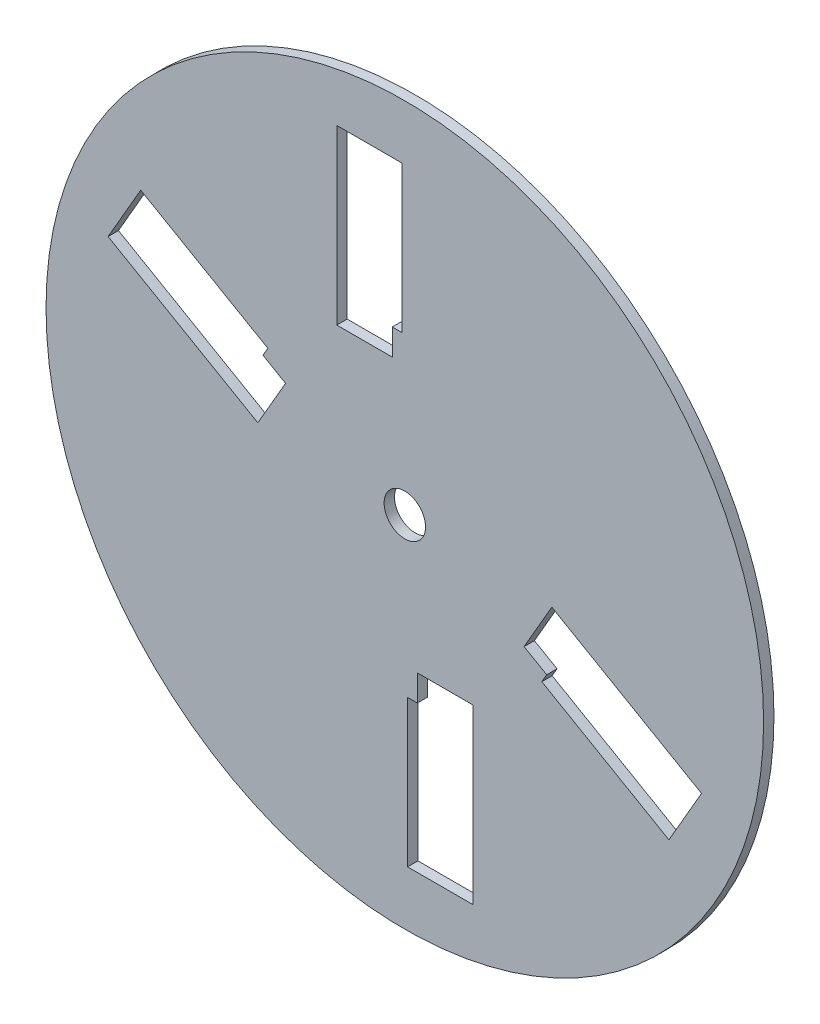
ISO-10303-21;
HEADER;
FILE_DESCRIPTION(('STEP AP214'),'2;1');
FILE_NAME('part.step','',(''),(''),'','','');
FILE_SCHEMA(('AUTOMOTIVE_DESIGN { 1 0 10303 214 1 1 1 1 }'));
ENDSEC;
DATA;
#1=APPLICATION_CONTEXT('core data for automotive mechanical design processes');
#2=APPLICATION_PROTOCOL_DEFINITION('international standard','automotive_design',2000,#1);
#3=PRODUCT_CONTEXT('',#1,'mechanical');
#4=PRODUCT('Part','Part','',(#3));
#5=PRODUCT_RELATED_PRODUCT_CATEGORY('part','',(#4));
#6=PRODUCT_DEFINITION_FORMATION('','',#4);
#7=PRODUCT_DEFINITION_CONTEXT('part definition',#1,'design');
#8=PRODUCT_DEFINITION('design','',#6,#7);
#9=PRODUCT_DEFINITION_SHAPE('','',#8);
#10=(LENGTH_UNIT() NAMED_UNIT(*) SI_UNIT(.MILLI.,.METRE.));
#11=(NAMED_UNIT(*) PLANE_ANGLE_UNIT() SI_UNIT($,.RADIAN.));
#12=(NAMED_UNIT(*) SI_UNIT($,.STERADIAN.) SOLID_ANGLE_UNIT());
#13=UNCERTAINTY_MEASURE_WITH_UNIT(LENGTH_MEASURE(1.E-05),#10,'distance_accuracy_value','');
#14=(GEOMETRIC_REPRESENTATION_CONTEXT(3) GLOBAL_UNCERTAINTY_ASSIGNED_CONTEXT((#13)) GLOBAL_UNIT_ASSIGNED_CONTEXT((#10,
#11,#12)) REPRESENTATION_CONTEXT('',''));
#15=CARTESIAN_POINT('',(0.,0.,0.));
#16=DIRECTION('',(0.,0.,1.));
#17=DIRECTION('',(1.,0.,0.));
#18=AXIS2_PLACEMENT_3D('',#15,#16,#17);
#19=CARTESIAN_POINT('',(-34.6410161513776,19.9999999999999,1.5875));
#20=DIRECTION('',(-0.86602540378444,0.499999999999998,0.));
#21=DIRECTION('',(-0.499999999999998,-0.86602540378444,0.));
#22=AXIS2_PLACEMENT_3D('',#19,#20,#21);
#23=PLANE('',#22);
#24=DIRECTION('',(0.499999999999998,0.86602540378444,0.));
#25=VECTOR('',#24,1.);
#26=CARTESIAN_POINT('',(-34.6410161513776,19.9999999999999,-1.5875));
#27=LINE('',#26,#25);
#28=CARTESIAN_POINT('',(-45.0660161513775,1.94337033109434,-1.5875));
#29=VERTEX_POINT('',#28);
#30=CARTESIAN_POINT('',(-36.5660161513776,16.6658021954298,-1.5875));
#31=VERTEX_POINT('',#30);
#32=EDGE_CURVE('E293',#29,#31,#27,.T.);
#33=ORIENTED_EDGE('',*,*,#32,.F.);
#34=DIRECTION('',(0.,0.,-1.));
#35=VECTOR('',#34,1.);
#36=CARTESIAN_POINT('',(-45.0660161513775,1.94337033109434,1.5875));
#37=LINE('',#36,#35);
#38=CARTESIAN_POINT('',(-45.0660161513775,1.94337033109434,1.5875));
#39=VERTEX_POINT('',#38);
#40=EDGE_CURVE('E11',#39,#29,#37,.T.);
#41=ORIENTED_EDGE('',*,*,#40,.F.);
#42=DIRECTION('',(0.499999999999998,0.86602540378444,0.));
#43=VECTOR('',#42,1.);
#44=CARTESIAN_POINT('',(-34.6410161513776,19.9999999999999,1.5875));
#45=LINE('',#44,#43);
#46=CARTESIAN_POINT('',(-36.5660161513776,16.6658021954298,1.5875));
#47=VERTEX_POINT('',#46);
#48=EDGE_CURVE('E418',#39,#47,#45,.T.);
#49=ORIENTED_EDGE('',*,*,#48,.T.);
#50=DIRECTION('',(0.,0.,-1.));
#51=VECTOR('',#50,1.);
#52=CARTESIAN_POINT('',(-36.5660161513776,16.6658021954298,1.5875));
#53=LINE('',#52,#51);
#54=EDGE_CURVE('E54',#47,#31,#53,.T.);
#55=ORIENTED_EDGE('',*,*,#54,.T.);
#56=EDGE_LOOP('',(#33,#41,#49,#55));
#57=FACE_BOUND('',#56,.T.);
#58=ADVANCED_FACE('F35',(#57),#23,.T.);
#59=CARTESIAN_POINT('',(-10.425,-18.0566296689056,1.5875));
#60=DIRECTION('',(0.499999999999998,0.86602540378444,0.));
#61=DIRECTION('',(-0.86602540378444,0.499999999999998,0.));
#62=AXIS2_PLACEMENT_3D('',#59,#60,#61);
#63=PLANE('',#62);
#64=DIRECTION('',(0.86602540378444,-0.499999999999998,0.));
#65=VECTOR('',#64,1.);
#66=CARTESIAN_POINT('',(-10.425,-18.0566296689056,-1.5875));
#67=LINE('',#66,#65);
#68=CARTESIAN_POINT('',(-90.9653625519529,28.4433703310942,-1.5875));
#69=VERTEX_POINT('',#68);
#70=EDGE_CURVE('E295',#69,#29,#67,.T.);
#71=ORIENTED_EDGE('',*,*,#70,.F.);
#72=DIRECTION('',(0.,0.,-1.));
#73=VECTOR('',#72,1.);
#74=CARTESIAN_POINT('',(-90.9653625519529,28.4433703310942,1.5875));
#75=LINE('',#74,#73);
#76=CARTESIAN_POINT('',(-90.9653625519529,28.4433703310942,1.5875));
#77=VERTEX_POINT('',#76);
#78=EDGE_CURVE('E45',#77,#69,#75,.T.);
#79=ORIENTED_EDGE('',*,*,#78,.F.);
#80=DIRECTION('',(0.86602540378444,-0.499999999999998,0.));
#81=VECTOR('',#80,1.);
#82=CARTESIAN_POINT('',(-10.425,-18.0566296689056,1.5875));
#83=LINE('',#82,#81);
#84=EDGE_CURVE('E420',#77,#39,#83,.T.);
#85=ORIENTED_EDGE('',*,*,#84,.T.);
#86=ORIENTED_EDGE('',*,*,#40,.T.);
#87=EDGE_LOOP('',(#71,#79,#85,#86));
#88=FACE_BOUND('',#87,.T.);
#89=ADVANCED_FACE('F445',(#88),#63,.T.);
#90=CARTESIAN_POINT('',(-80.5403625519529,46.4999999999998,1.5875));
#91=DIRECTION('',(0.86602540378444,-0.499999999999998,0.));
#92=DIRECTION('',(0.499999999999998,0.86602540378444,0.));
#93=AXIS2_PLACEMENT_3D('',#90,#91,#92);
#94=PLANE('',#93);
#95=DIRECTION('',(-0.499999999999998,-0.86602540378444,0.));
#96=VECTOR('',#95,1.);
#97=CARTESIAN_POINT('',(-80.5403625519529,46.4999999999998,-1.5875));
#98=LINE('',#97,#96);
#99=CARTESIAN_POINT('',(-80.9653625519529,45.763878406783,-1.5875));
#100=VERTEX_POINT('',#99);
#101=EDGE_CURVE('E298',#100,#69,#98,.T.);
#102=ORIENTED_EDGE('',*,*,#101,.F.);
#103=DIRECTION('',(0.,0.,-1.));
#104=VECTOR('',#103,1.);
#105=CARTESIAN_POINT('',(-80.9653625519529,45.763878406783,1.5875));
#106=LINE('',#105,#104);
#107=CARTESIAN_POINT('',(-80.9653625519529,45.763878406783,1.5875));
#108=VERTEX_POINT('',#107);
#109=EDGE_CURVE('E212',#108,#100,#106,.T.);
#110=ORIENTED_EDGE('',*,*,#109,.F.);
#111=DIRECTION('',(-0.499999999999998,-0.86602540378444,0.));
#112=VECTOR('',#111,1.);
#113=CARTESIAN_POINT('',(-80.5403625519529,46.4999999999998,1.5875));
#114=LINE('',#113,#112);
#115=EDGE_CURVE('E224',#108,#77,#114,.T.);
#116=ORIENTED_EDGE('',*,*,#115,.T.);
#117=ORIENTED_EDGE('',*,*,#78,.T.);
#118=EDGE_LOOP('',(#102,#110,#116,#117));
#119=FACE_BOUND('',#118,.T.);
#120=ADVANCED_FACE('F424',(#119),#94,.T.);
#121=CARTESIAN_POINT('',(-0.424999999999998,-0.736121593216774,1.5875));
#122=DIRECTION('',(-0.499999999999998,-0.86602540378444,0.));
#123=DIRECTION('',(0.86602540378444,-0.499999999999998,0.));
#124=AXIS2_PLACEMENT_3D('',#121,#122,#123);
#125=PLANE('',#124);
#126=DIRECTION('',(-0.86602540378444,0.499999999999998,0.));
#127=VECTOR('',#126,1.);
#128=CARTESIAN_POINT('',(-0.424999999999998,-0.736121593216774,-1.5875));
#129=LINE('',#128,#127);
#130=CARTESIAN_POINT('',(-41.9942193816531,23.2638784067831,-1.5875));
#131=VERTEX_POINT('',#130);
#132=EDGE_CURVE('E208',#131,#100,#129,.T.);
#133=ORIENTED_EDGE('',*,*,#132,.F.);
#134=DIRECTION('',(0.,0.,-1.));
#135=VECTOR('',#134,1.);
#136=CARTESIAN_POINT('',(-41.9942193816531,23.2638784067831,1.5875));
#137=LINE('',#136,#135);
#138=CARTESIAN_POINT('',(-41.9942193816531,23.2638784067831,1.5875));
#139=VERTEX_POINT('',#138);
#140=EDGE_CURVE('E203',#139,#131,#137,.T.);
#141=ORIENTED_EDGE('',*,*,#140,.F.);
#142=DIRECTION('',(-0.86602540378444,0.499999999999998,0.));
#143=VECTOR('',#142,1.);
#144=CARTESIAN_POINT('',(-0.424999999999998,-0.736121593216774,1.5875));
#145=LINE('',#144,#143);
#146=EDGE_CURVE('E206',#139,#108,#145,.T.);
#147=ORIENTED_EDGE('',*,*,#146,.T.);
#148=ORIENTED_EDGE('',*,*,#109,.T.);
#149=EDGE_LOOP('',(#133,#141,#147,#148));
#150=FACE_BOUND('',#149,.T.);
#151=ADVANCED_FACE('F205',(#150),#125,.T.);
#152=CARTESIAN_POINT('',(-41.5692193816531,23.9999999999999,1.5875));
#153=DIRECTION('',(-0.86602540378444,0.499999999999998,0.));
#154=DIRECTION('',(-0.499999999999998,-0.86602540378444,0.));
#155=AXIS2_PLACEMENT_3D('',#152,#153,#154);
#156=PLANE('',#155);
#157=DIRECTION('',(0.499999999999998,0.86602540378444,0.));
#158=VECTOR('',#157,1.);
#159=CARTESIAN_POINT('',(-41.5692193816531,23.9999999999999,-1.5875));
#160=LINE('',#159,#158);
#161=CARTESIAN_POINT('',(-43.4942193816531,20.6658021954298,-1.5875));
#162=VERTEX_POINT('',#161);
#163=EDGE_CURVE('E302',#162,#131,#160,.T.);
#164=ORIENTED_EDGE('',*,*,#163,.F.);
#165=DIRECTION('',(0.,0.,-1.));
#166=VECTOR('',#165,1.);
#167=CARTESIAN_POINT('',(-43.4942193816531,20.6658021954298,1.5875));
#168=LINE('',#167,#166);
#169=CARTESIAN_POINT('',(-43.4942193816531,20.6658021954298,1.5875));
#170=VERTEX_POINT('',#169);
#171=EDGE_CURVE('E127',#170,#162,#168,.T.);
#172=ORIENTED_EDGE('',*,*,#171,.F.);
#173=DIRECTION('',(0.499999999999998,0.86602540378444,0.));
#174=VECTOR('',#173,1.);
#175=CARTESIAN_POINT('',(-41.5692193816531,23.9999999999999,1.5875));
#176=LINE('',#175,#174);
#177=EDGE_CURVE('E221',#170,#139,#176,.T.);
#178=ORIENTED_EDGE('',*,*,#177,.T.);
#179=ORIENTED_EDGE('',*,*,#140,.T.);
#180=EDGE_LOOP('',(#164,#172,#178,#179));
#181=FACE_BOUND('',#180,.T.);
#182=ADVANCED_FACE('F226',(#181),#156,.T.);
#183=CARTESIAN_POINT('',(34.6410161513776,-19.9999999999999,1.5875));
#184=DIRECTION('',(0.86602540378444,-0.499999999999998,0.));
#185=DIRECTION('',(0.499999999999998,0.86602540378444,0.));
#186=AXIS2_PLACEMENT_3D('',#183,#184,#185);
#187=PLANE('',#186);
#188=DIRECTION('',(-0.499999999999998,-0.86602540378444,0.));
#189=VECTOR('',#188,1.);
#190=CARTESIAN_POINT('',(34.6410161513776,-19.9999999999999,-1.5875));
#191=LINE('',#190,#189);
#192=CARTESIAN_POINT('',(45.0660161513775,-1.94337033109434,-1.5875));
#193=VERTEX_POINT('',#192);
#194=CARTESIAN_POINT('',(36.5660161513776,-16.6658021954298,-1.5875));
#195=VERTEX_POINT('',#194);
#196=EDGE_CURVE('E275',#193,#195,#191,.T.);
#197=ORIENTED_EDGE('',*,*,#196,.F.);
#198=DIRECTION('',(0.,0.,-1.));
#199=VECTOR('',#198,1.);
#200=CARTESIAN_POINT('',(45.0660161513775,-1.94337033109434,1.5875));
#201=LINE('',#200,#199);
#202=CARTESIAN_POINT('',(45.0660161513775,-1.94337033109434,1.5875));
#203=VERTEX_POINT('',#202);
#204=EDGE_CURVE('E312',#203,#193,#201,.T.);
#205=ORIENTED_EDGE('',*,*,#204,.F.);
#206=DIRECTION('',(-0.499999999999998,-0.86602540378444,0.));
#207=VECTOR('',#206,1.);
#208=CARTESIAN_POINT('',(34.6410161513776,-19.9999999999999,1.5875));
#209=LINE('',#208,#207);
#210=CARTESIAN_POINT('',(36.5660161513776,-16.6658021954298,1.5875));
#211=VERTEX_POINT('',#210);
#212=EDGE_CURVE('E400',#203,#211,#209,.T.);
#213=ORIENTED_EDGE('',*,*,#212,.T.);
#214=DIRECTION('',(0.,0.,-1.));
#215=VECTOR('',#214,1.);
#216=CARTESIAN_POINT('',(36.5660161513776,-16.6658021954298,1.5875));
#217=LINE('',#216,#215);
#218=EDGE_CURVE('E316',#211,#195,#217,.T.);
#219=ORIENTED_EDGE('',*,*,#218,.T.);
#220=EDGE_LOOP('',(#197,#205,#213,#219));
#221=FACE_BOUND('',#220,.T.);
#222=ADVANCED_FACE('F470',(#221),#187,.T.);
#223=CARTESIAN_POINT('',(10.4249999999999,18.0566296689056,1.5875));
#224=DIRECTION('',(-0.499999999999997,-0.86602540378444,0.));
#225=DIRECTION('',(0.86602540378444,-0.499999999999997,0.));
#226=AXIS2_PLACEMENT_3D('',#223,#224,#225);
#227=PLANE('',#226);
#228=DIRECTION('',(-0.86602540378444,0.499999999999997,0.));
#229=VECTOR('',#228,1.);
#230=CARTESIAN_POINT('',(10.4249999999999,18.0566296689056,-1.5875));
#231=LINE('',#230,#229);
#232=CARTESIAN_POINT('',(90.9653625519529,-28.4433703310942,-1.5875));
#233=VERTEX_POINT('',#232);
#234=EDGE_CURVE('E278',#233,#193,#231,.T.);
#235=ORIENTED_EDGE('',*,*,#234,.F.);
#236=DIRECTION('',(0.,0.,-1.));
#237=VECTOR('',#236,1.);
#238=CARTESIAN_POINT('',(90.9653625519529,-28.4433703310942,1.5875));
#239=LINE('',#238,#237);
#240=CARTESIAN_POINT('',(90.9653625519529,-28.4433703310942,1.5875));
#241=VERTEX_POINT('',#240);
#242=EDGE_CURVE('E325',#241,#233,#239,.T.);
#243=ORIENTED_EDGE('',*,*,#242,.F.);
#244=DIRECTION('',(-0.86602540378444,0.499999999999997,0.));
#245=VECTOR('',#244,1.);
#246=CARTESIAN_POINT('',(10.4249999999999,18.0566296689056,1.5875));
#247=LINE('',#246,#245);
#248=EDGE_CURVE('E403',#241,#203,#247,.T.);
#249=ORIENTED_EDGE('',*,*,#248,.T.);
#250=ORIENTED_EDGE('',*,*,#204,.T.);
#251=EDGE_LOOP('',(#235,#243,#249,#250));
#252=FACE_BOUND('',#251,.T.);
#253=ADVANCED_FACE('F466',(#252),#227,.T.);
#254=CARTESIAN_POINT('',(80.5403625519529,-46.4999999999998,1.5875));
#255=DIRECTION('',(-0.86602540378444,0.499999999999998,0.));
#256=DIRECTION('',(-0.499999999999998,-0.86602540378444,0.));
#257=AXIS2_PLACEMENT_3D('',#254,#255,#256);
#258=PLANE('',#257);
#259=DIRECTION('',(0.499999999999998,0.86602540378444,0.));
#260=VECTOR('',#259,1.);
#261=CARTESIAN_POINT('',(80.5403625519529,-46.4999999999998,-1.5875));
#262=LINE('',#261,#260);
#263=CARTESIAN_POINT('',(80.9653625519529,-45.763878406783,-1.5875));
#264=VERTEX_POINT('',#263);
#265=EDGE_CURVE('E281',#264,#233,#262,.T.);
#266=ORIENTED_EDGE('',*,*,#265,.F.);
#267=DIRECTION('',(0.,0.,-1.));
#268=VECTOR('',#267,1.);
#269=CARTESIAN_POINT('',(80.9653625519529,-45.763878406783,1.5875));
#270=LINE('',#269,#268);
#271=CARTESIAN_POINT('',(80.9653625519529,-45.763878406783,1.5875));
#272=VERTEX_POINT('',#271);
#273=EDGE_CURVE('E323',#272,#264,#270,.T.);
#274=ORIENTED_EDGE('',*,*,#273,.F.);
#275=DIRECTION('',(0.499999999999998,0.86602540378444,0.));
#276=VECTOR('',#275,1.);
#277=CARTESIAN_POINT('',(80.5403625519529,-46.4999999999998,1.5875));
#278=LINE('',#277,#276);
#279=EDGE_CURVE('E406',#272,#241,#278,.T.);
#280=ORIENTED_EDGE('',*,*,#279,.T.);
#281=ORIENTED_EDGE('',*,*,#242,.T.);
#282=EDGE_LOOP('',(#266,#274,#280,#281));
#283=FACE_BOUND('',#282,.T.);
#284=ADVANCED_FACE('F462',(#283),#258,.T.);
#285=CARTESIAN_POINT('',(0.424999999999996,0.736121593216771,1.5875));
#286=DIRECTION('',(0.499999999999998,0.86602540378444,0.));
#287=DIRECTION('',(-0.86602540378444,0.499999999999998,0.));
#288=AXIS2_PLACEMENT_3D('',#285,#286,#287);
#289=PLANE('',#288);
#290=DIRECTION('',(0.86602540378444,-0.499999999999998,0.));
#291=VECTOR('',#290,1.);
#292=CARTESIAN_POINT('',(0.424999999999996,0.736121593216771,-1.5875));
#293=LINE('',#292,#291);
#294=CARTESIAN_POINT('',(41.9942193816531,-23.2638784067831,-1.5875));
#295=VERTEX_POINT('',#294);
#296=EDGE_CURVE('E284',#295,#264,#293,.T.);
#297=ORIENTED_EDGE('',*,*,#296,.F.);
#298=DIRECTION('',(0.,0.,-1.));
#299=VECTOR('',#298,1.);
#300=CARTESIAN_POINT('',(41.9942193816531,-23.2638784067831,1.5875));
#301=LINE('',#300,#299);
#302=CARTESIAN_POINT('',(41.9942193816531,-23.2638784067831,1.5875));
#303=VERTEX_POINT('',#302);
#304=EDGE_CURVE('E321',#303,#295,#301,.T.);
#305=ORIENTED_EDGE('',*,*,#304,.F.);
#306=DIRECTION('',(0.86602540378444,-0.499999999999998,0.));
#307=VECTOR('',#306,1.);
#308=CARTESIAN_POINT('',(0.424999999999996,0.736121593216771,1.5875));
#309=LINE('',#308,#307);
#310=EDGE_CURVE('E409',#303,#272,#309,.T.);
#311=ORIENTED_EDGE('',*,*,#310,.T.);
#312=ORIENTED_EDGE('',*,*,#273,.T.);
#313=EDGE_LOOP('',(#297,#305,#311,#312));
#314=FACE_BOUND('',#313,.T.);
#315=ADVANCED_FACE('F458',(#314),#289,.T.);
#316=CARTESIAN_POINT('',(41.5692193816531,-23.9999999999999,1.5875));
#317=DIRECTION('',(0.86602540378444,-0.499999999999998,0.));
#318=DIRECTION('',(0.499999999999998,0.86602540378444,0.));
#319=AXIS2_PLACEMENT_3D('',#316,#317,#318);
#320=PLANE('',#319);
#321=DIRECTION('',(-0.499999999999998,-0.86602540378444,0.));
#322=VECTOR('',#321,1.);
#323=CARTESIAN_POINT('',(41.5692193816531,-23.9999999999999,-1.5875));
#324=LINE('',#323,#322);
#325=CARTESIAN_POINT('',(43.4942193816531,-20.6658021954298,-1.5875));
#326=VERTEX_POINT('',#325);
#327=EDGE_CURVE('E287',#326,#295,#324,.T.);
#328=ORIENTED_EDGE('',*,*,#327,.F.);
#329=DIRECTION('',(0.,0.,-1.));
#330=VECTOR('',#329,1.);
#331=CARTESIAN_POINT('',(43.4942193816531,-20.6658021954298,1.5875));
#332=LINE('',#331,#330);
#333=CARTESIAN_POINT('',(43.4942193816531,-20.6658021954298,1.5875));
#334=VERTEX_POINT('',#333);
#335=EDGE_CURVE('E318',#334,#326,#332,.T.);
#336=ORIENTED_EDGE('',*,*,#335,.F.);
#337=DIRECTION('',(-0.499999999999998,-0.86602540378444,0.));
#338=VECTOR('',#337,1.);
#339=CARTESIAN_POINT('',(41.5692193816531,-23.9999999999999,1.5875));
#340=LINE('',#339,#338);
#341=EDGE_CURVE('E412',#334,#303,#340,.T.);
#342=ORIENTED_EDGE('',*,*,#341,.T.);
#343=ORIENTED_EDGE('',*,*,#304,.T.);
#344=EDGE_LOOP('',(#328,#336,#342,#343));
#345=FACE_BOUND('',#344,.T.);
#346=ADVANCED_FACE('F454',(#345),#320,.T.);
#347=CARTESIAN_POINT('',(0.,-40.,1.5875));
#348=DIRECTION('',(0.,-1.,0.));
#349=DIRECTION('',(0.,0.,-1.));
#350=AXIS2_PLACEMENT_3D('',#347,#348,#349);
#351=PLANE('',#350);
#352=DIRECTION('',(-1.,0.,0.));
#353=VECTOR('',#352,1.);
#354=CARTESIAN_POINT('',(0.,-40.,-1.5875));
#355=LINE('',#354,#353);
#356=CARTESIAN_POINT('',(20.85,-40.,-1.5875));
#357=VERTEX_POINT('',#356);
#358=CARTESIAN_POINT('',(3.85,-40.,-1.5875));
#359=VERTEX_POINT('',#358);
#360=EDGE_CURVE('E257',#357,#359,#355,.T.);
#361=ORIENTED_EDGE('',*,*,#360,.F.);
#362=DIRECTION('',(0.,0.,-1.));
#363=VECTOR('',#362,1.);
#364=CARTESIAN_POINT('',(20.85,-40.,1.5875));
#365=LINE('',#364,#363);
#366=CARTESIAN_POINT('',(20.85,-40.,1.5875));
#367=VERTEX_POINT('',#366);
#368=EDGE_CURVE('E319',#367,#357,#365,.T.);
#369=ORIENTED_EDGE('',*,*,#368,.F.);
#370=DIRECTION('',(-1.,0.,0.));
#371=VECTOR('',#370,1.);
#372=CARTESIAN_POINT('',(0.,-40.,1.5875));
#373=LINE('',#372,#371);
#374=CARTESIAN_POINT('',(3.85,-40.,1.5875));
#375=VERTEX_POINT('',#374);
#376=EDGE_CURVE('E382',#367,#375,#373,.T.);
#377=ORIENTED_EDGE('',*,*,#376,.T.);
#378=DIRECTION('',(0.,0.,-1.));
#379=VECTOR('',#378,1.);
#380=CARTESIAN_POINT('',(3.85,-40.,1.5875));
#381=LINE('',#380,#379);
#382=EDGE_CURVE('E328',#375,#359,#381,.T.);
#383=ORIENTED_EDGE('',*,*,#382,.T.);
#384=EDGE_LOOP('',(#361,#369,#377,#383));
#385=FACE_BOUND('',#384,.T.);
#386=ADVANCED_FACE('F457',(#385),#351,.T.);
#387=CARTESIAN_POINT('',(20.85,0.,1.5875));
#388=DIRECTION('',(-1.,0.,0.));
#389=DIRECTION('',(0.,-1.,0.));
#390=AXIS2_PLACEMENT_3D('',#387,#388,#389);
#391=PLANE('',#390);
#392=DIRECTION('',(0.,1.,0.));
#393=VECTOR('',#392,1.);
#394=CARTESIAN_POINT('',(20.85,0.,-1.5875));
#395=LINE('',#394,#393);
#396=CARTESIAN_POINT('',(20.85,-93.,-1.5875));
#397=VERTEX_POINT('',#396);
#398=EDGE_CURVE('E260',#397,#357,#395,.T.);
#399=ORIENTED_EDGE('',*,*,#398,.F.);
#400=DIRECTION('',(0.,0.,-1.));
#401=VECTOR('',#400,1.);
#402=CARTESIAN_POINT('',(20.85,-93.,1.5875));
#403=LINE('',#402,#401);
#404=CARTESIAN_POINT('',(20.85,-93.,1.5875));
#405=VERTEX_POINT('',#404);
#406=EDGE_CURVE('E336',#405,#397,#403,.T.);
#407=ORIENTED_EDGE('',*,*,#406,.F.);
#408=DIRECTION('',(0.,1.,0.));
#409=VECTOR('',#408,1.);
#410=CARTESIAN_POINT('',(20.85,0.,1.5875));
#411=LINE('',#410,#409);
#412=EDGE_CURVE('E385',#405,#367,#411,.T.);
#413=ORIENTED_EDGE('',*,*,#412,.T.);
#414=ORIENTED_EDGE('',*,*,#368,.T.);
#415=EDGE_LOOP('',(#399,#407,#413,#414));
#416=FACE_BOUND('',#415,.T.);
#417=ADVANCED_FACE('F490',(#416),#391,.T.);
#418=CARTESIAN_POINT('',(0.,-93.,1.5875));
#419=DIRECTION('',(0.,1.,0.));
#420=DIRECTION('',(0.,0.,1.));
#421=AXIS2_PLACEMENT_3D('',#418,#419,#420);
#422=PLANE('',#421);
#423=DIRECTION('',(1.,0.,0.));
#424=VECTOR('',#423,1.);
#425=CARTESIAN_POINT('',(0.,-93.,-1.5875));
#426=LINE('',#425,#424);
#427=CARTESIAN_POINT('',(0.849999999999995,-93.,-1.5875));
#428=VERTEX_POINT('',#427);
#429=EDGE_CURVE('E263',#428,#397,#426,.T.);
#430=ORIENTED_EDGE('',*,*,#429,.F.);
#431=DIRECTION('',(0.,0.,-1.));
#432=VECTOR('',#431,1.);
#433=CARTESIAN_POINT('',(0.849999999999995,-93.,1.5875));
#434=LINE('',#433,#432);
#435=CARTESIAN_POINT('',(0.849999999999995,-93.,1.5875));
#436=VERTEX_POINT('',#435);
#437=EDGE_CURVE('E334',#436,#428,#434,.T.);
#438=ORIENTED_EDGE('',*,*,#437,.F.);
#439=DIRECTION('',(1.,0.,0.));
#440=VECTOR('',#439,1.);
#441=CARTESIAN_POINT('',(0.,-93.,1.5875));
#442=LINE('',#441,#440);
#443=EDGE_CURVE('E388',#436,#405,#442,.T.);
#444=ORIENTED_EDGE('',*,*,#443,.T.);
#445=ORIENTED_EDGE('',*,*,#406,.T.);
#446=EDGE_LOOP('',(#430,#438,#444,#445));
#447=FACE_BOUND('',#446,.T.);
#448=ADVANCED_FACE('F486',(#447),#422,.T.);
#449=CARTESIAN_POINT('',(0.85,0.,1.5875));
#450=DIRECTION('',(1.,0.,0.));
#451=DIRECTION('',(0.,1.,0.));
#452=AXIS2_PLACEMENT_3D('',#449,#450,#451);
#453=PLANE('',#452);
#454=DIRECTION('',(0.,-1.,0.));
#455=VECTOR('',#454,1.);
#456=CARTESIAN_POINT('',(0.85,0.,-1.5875));
#457=LINE('',#456,#455);
#458=CARTESIAN_POINT('',(0.849999999999997,-48.,-1.5875));
#459=VERTEX_POINT('',#458);
#460=EDGE_CURVE('E266',#459,#428,#457,.T.);
#461=ORIENTED_EDGE('',*,*,#460,.F.);
#462=DIRECTION('',(0.,0.,-1.));
#463=VECTOR('',#462,1.);
#464=CARTESIAN_POINT('',(0.849999999999997,-48.,1.5875));
#465=LINE('',#464,#463);
#466=CARTESIAN_POINT('',(0.849999999999997,-48.,1.5875));
#467=VERTEX_POINT('',#466);
#468=EDGE_CURVE('E332',#467,#459,#465,.T.);
#469=ORIENTED_EDGE('',*,*,#468,.F.);
#470=DIRECTION('',(0.,-1.,0.));
#471=VECTOR('',#470,1.);
#472=CARTESIAN_POINT('',(0.85,0.,1.5875));
#473=LINE('',#472,#471);
#474=EDGE_CURVE('E391',#467,#436,#473,.T.);
#475=ORIENTED_EDGE('',*,*,#474,.T.);
#476=ORIENTED_EDGE('',*,*,#437,.T.);
#477=EDGE_LOOP('',(#461,#469,#475,#476));
#478=FACE_BOUND('',#477,.T.);
#479=ADVANCED_FACE('F482',(#478),#453,.T.);
#480=CARTESIAN_POINT('',(0.,-48.,1.5875));
#481=DIRECTION('',(0.,-1.,0.));
#482=DIRECTION('',(0.,0.,-1.));
#483=AXIS2_PLACEMENT_3D('',#480,#481,#482);
#484=PLANE('',#483);
#485=DIRECTION('',(-1.,0.,0.));
#486=VECTOR('',#485,1.);
#487=CARTESIAN_POINT('',(0.,-48.,-1.5875));
#488=LINE('',#487,#486);
#489=CARTESIAN_POINT('',(3.85,-48.,-1.5875));
#490=VERTEX_POINT('',#489);
#491=EDGE_CURVE('E269',#490,#459,#488,.T.);
#492=ORIENTED_EDGE('',*,*,#491,.F.);
#493=DIRECTION('',(0.,0.,-1.));
#494=VECTOR('',#493,1.);
#495=CARTESIAN_POINT('',(3.85,-48.,1.5875));
#496=LINE('',#495,#494);
#497=CARTESIAN_POINT('',(3.85,-48.,1.5875));
#498=VERTEX_POINT('',#497);
#499=EDGE_CURVE('E330',#498,#490,#496,.T.);
#500=ORIENTED_EDGE('',*,*,#499,.F.);
#501=DIRECTION('',(-1.,0.,0.));
#502=VECTOR('',#501,1.);
#503=CARTESIAN_POINT('',(0.,-48.,1.5875));
#504=LINE('',#503,#502);
#505=EDGE_CURVE('E394',#498,#467,#504,.T.);
#506=ORIENTED_EDGE('',*,*,#505,.T.);
#507=ORIENTED_EDGE('',*,*,#468,.T.);
#508=EDGE_LOOP('',(#492,#500,#506,#507));
#509=FACE_BOUND('',#508,.T.);
#510=ADVANCED_FACE('F479',(#509),#484,.T.);
#511=CARTESIAN_POINT('',(-3.85,0.,1.5875));
#512=DIRECTION('',(-1.,0.,0.));
#513=DIRECTION('',(0.,-1.,0.));
#514=AXIS2_PLACEMENT_3D('',#511,#512,#513);
#515=PLANE('',#514);
#516=DIRECTION('',(0.,1.,0.));
#517=VECTOR('',#516,1.);
#518=CARTESIAN_POINT('',(-3.85,0.,-1.5875));
#519=LINE('',#518,#517);
#520=CARTESIAN_POINT('',(-3.85,40.,-1.5875));
#521=VERTEX_POINT('',#520);
#522=CARTESIAN_POINT('',(-3.85,48.,-1.5875));
#523=VERTEX_POINT('',#522);
#524=EDGE_CURVE('E239',#521,#523,#519,.T.);
#525=ORIENTED_EDGE('',*,*,#524,.F.);
#526=DIRECTION('',(0.,0.,-1.));
#527=VECTOR('',#526,1.);
#528=CARTESIAN_POINT('',(-3.85,40.,1.5875));
#529=LINE('',#528,#527);
#530=CARTESIAN_POINT('',(-3.85,40.,1.5875));
#531=VERTEX_POINT('',#530);
#532=EDGE_CURVE('E39',#531,#521,#529,.T.);
#533=ORIENTED_EDGE('',*,*,#532,.F.);
#534=DIRECTION('',(0.,1.,0.));
#535=VECTOR('',#534,1.);
#536=CARTESIAN_POINT('',(-3.85,0.,1.5875));
#537=LINE('',#536,#535);
#538=CARTESIAN_POINT('',(-3.85,48.,1.5875));
#539=VERTEX_POINT('',#538);
#540=EDGE_CURVE('E592',#531,#539,#537,.T.);
#541=ORIENTED_EDGE('',*,*,#540,.T.);
#542=DIRECTION('',(0.,0.,-1.));
#543=VECTOR('',#542,1.);
#544=CARTESIAN_POINT('',(-3.85,48.,1.5875));
#545=LINE('',#544,#543);
#546=EDGE_CURVE('E235',#539,#523,#545,.T.);
#547=ORIENTED_EDGE('',*,*,#546,.T.);
#548=EDGE_LOOP('',(#525,#533,#541,#547));
#549=FACE_BOUND('',#548,.T.);
#550=ADVANCED_FACE('F355',(#549),#515,.T.);
#551=CARTESIAN_POINT('',(0.,40.,1.5875));
#552=DIRECTION('',(0.,1.,0.));
#553=DIRECTION('',(0.,0.,1.));
#554=AXIS2_PLACEMENT_3D('',#551,#552,#553);
#555=PLANE('',#554);
#556=DIRECTION('',(1.,0.,0.));
#557=VECTOR('',#556,1.);
#558=CARTESIAN_POINT('',(0.,40.,-1.5875));
#559=LINE('',#558,#557);
#560=CARTESIAN_POINT('',(-20.85,40.,-1.5875));
#561=VERTEX_POINT('',#560);
#562=EDGE_CURVE('E242',#561,#521,#559,.T.);
#563=ORIENTED_EDGE('',*,*,#562,.F.);
#564=DIRECTION('',(0.,0.,-1.));
#565=VECTOR('',#564,1.);
#566=CARTESIAN_POINT('',(-20.85,40.,1.5875));
#567=LINE('',#566,#565);
#568=CARTESIAN_POINT('',(-20.85,40.,1.5875));
#569=VERTEX_POINT('',#568);
#570=EDGE_CURVE('E345',#569,#561,#567,.T.);
#571=ORIENTED_EDGE('',*,*,#570,.F.);
#572=DIRECTION('',(1.,0.,0.));
#573=VECTOR('',#572,1.);
#574=CARTESIAN_POINT('',(0.,40.,1.5875));
#575=LINE('',#574,#573);
#576=EDGE_CURVE('E354',#569,#531,#575,.T.);
#577=ORIENTED_EDGE('',*,*,#576,.T.);
#578=ORIENTED_EDGE('',*,*,#532,.T.);
#579=EDGE_LOOP('',(#563,#571,#577,#578));
#580=FACE_BOUND('',#579,.T.);
#581=ADVANCED_FACE('F352',(#580),#555,.T.);
#582=CARTESIAN_POINT('',(-20.85,0.,1.5875));
#583=DIRECTION('',(1.,0.,0.));
#584=DIRECTION('',(0.,1.,0.));
#585=AXIS2_PLACEMENT_3D('',#582,#583,#584);
#586=PLANE('',#585);
#587=DIRECTION('',(0.,-1.,0.));
#588=VECTOR('',#587,1.);
#589=CARTESIAN_POINT('',(-20.85,0.,-1.5875));
#590=LINE('',#589,#588);
#591=CARTESIAN_POINT('',(-20.85,93.,-1.5875));
#592=VERTEX_POINT('',#591);
#593=EDGE_CURVE('E245',#592,#561,#590,.T.);
#594=ORIENTED_EDGE('',*,*,#593,.F.);
#595=DIRECTION('',(0.,0.,-1.));
#596=VECTOR('',#595,1.);
#597=CARTESIAN_POINT('',(-20.85,93.,1.5875));
#598=LINE('',#597,#596);
#599=CARTESIAN_POINT('',(-20.85,93.,1.5875));
#600=VERTEX_POINT('',#599);
#601=EDGE_CURVE('E344',#600,#592,#598,.T.);
#602=ORIENTED_EDGE('',*,*,#601,.F.);
#603=DIRECTION('',(0.,-1.,0.));
#604=VECTOR('',#603,1.);
#605=CARTESIAN_POINT('',(-20.85,0.,1.5875));
#606=LINE('',#605,#604);
#607=EDGE_CURVE('E363',#600,#569,#606,.T.);
#608=ORIENTED_EDGE('',*,*,#607,.T.);
#609=ORIENTED_EDGE('',*,*,#570,.T.);
#610=EDGE_LOOP('',(#594,#602,#608,#609));
#611=FACE_BOUND('',#610,.T.);
#612=ADVANCED_FACE('F361',(#611),#586,.T.);
#613=CARTESIAN_POINT('',(0.,93.,1.5875));
#614=DIRECTION('',(0.,-1.,0.));
#615=DIRECTION('',(0.,0.,-1.));
#616=AXIS2_PLACEMENT_3D('',#613,#614,#615);
#617=PLANE('',#616);
#618=DIRECTION('',(-1.,0.,0.));
#619=VECTOR('',#618,1.);
#620=CARTESIAN_POINT('',(0.,93.,-1.5875));
#621=LINE('',#620,#619);
#622=CARTESIAN_POINT('',(-0.850000000000011,93.,-1.5875));
#623=VERTEX_POINT('',#622);
#624=EDGE_CURVE('E248',#623,#592,#621,.T.);
#625=ORIENTED_EDGE('',*,*,#624,.F.);
#626=DIRECTION('',(0.,0.,-1.));
#627=VECTOR('',#626,1.);
#628=CARTESIAN_POINT('',(-0.850000000000011,93.,1.5875));
#629=LINE('',#628,#627);
#630=CARTESIAN_POINT('',(-0.850000000000011,93.,1.5875));
#631=VERTEX_POINT('',#630);
#632=EDGE_CURVE('E342',#631,#623,#629,.T.);
#633=ORIENTED_EDGE('',*,*,#632,.F.);
#634=DIRECTION('',(-1.,0.,0.));
#635=VECTOR('',#634,1.);
#636=CARTESIAN_POINT('',(0.,93.,1.5875));
#637=LINE('',#636,#635);
#638=EDGE_CURVE('E370',#631,#600,#637,.T.);
#639=ORIENTED_EDGE('',*,*,#638,.T.);
#640=ORIENTED_EDGE('',*,*,#601,.T.);
#641=EDGE_LOOP('',(#625,#633,#639,#640));
#642=FACE_BOUND('',#641,.T.);
#643=ADVANCED_FACE('F373',(#642),#617,.T.);
#644=CARTESIAN_POINT('',(-0.849999999999994,0.,1.5875));
#645=DIRECTION('',(-1.,0.,0.));
#646=DIRECTION('',(0.,-1.,0.));
#647=AXIS2_PLACEMENT_3D('',#644,#645,#646);
#648=PLANE('',#647);
#649=DIRECTION('',(0.,1.,0.));
#650=VECTOR('',#649,1.);
#651=CARTESIAN_POINT('',(-0.849999999999994,0.,-1.5875));
#652=LINE('',#651,#650);
#653=CARTESIAN_POINT('',(-0.850000000000003,48.,-1.5875));
#654=VERTEX_POINT('',#653);
#655=EDGE_CURVE('E251',#654,#623,#652,.T.);
#656=ORIENTED_EDGE('',*,*,#655,.F.);
#657=DIRECTION('',(0.,0.,-1.));
#658=VECTOR('',#657,1.);
#659=CARTESIAN_POINT('',(-0.850000000000003,48.,1.5875));
#660=LINE('',#659,#658);
#661=CARTESIAN_POINT('',(-0.850000000000003,48.,1.5875));
#662=VERTEX_POINT('',#661);
#663=EDGE_CURVE('E340',#662,#654,#660,.T.);
#664=ORIENTED_EDGE('',*,*,#663,.F.);
#665=DIRECTION('',(0.,1.,0.));
#666=VECTOR('',#665,1.);
#667=CARTESIAN_POINT('',(-0.849999999999994,0.,1.5875));
#668=LINE('',#667,#666);
#669=EDGE_CURVE('E374',#662,#631,#668,.T.);
#670=ORIENTED_EDGE('',*,*,#669,.T.);
#671=ORIENTED_EDGE('',*,*,#632,.T.);
#672=EDGE_LOOP('',(#656,#664,#670,#671));
#673=FACE_BOUND('',#672,.T.);
#674=ADVANCED_FACE('F431',(#673),#648,.T.);
#675=CARTESIAN_POINT('',(-1.92500000000005,-3.33419780457018,1.5875));
#676=DIRECTION('',(-0.5,-0.866025403784439,0.));
#677=DIRECTION('',(0.866025403784439,-0.5,0.));
#678=AXIS2_PLACEMENT_3D('',#675,#676,#677);
#679=PLANE('',#678);
#680=DIRECTION('',(-0.866025403784439,0.5,0.));
#681=VECTOR('',#680,1.);
#682=CARTESIAN_POINT('',(-1.92500000000005,-3.33419780457018,-1.5875));
#683=LINE('',#682,#681);
#684=EDGE_CURVE('E304',#31,#162,#683,.T.);
#685=ORIENTED_EDGE('',*,*,#684,.F.);
#686=ORIENTED_EDGE('',*,*,#54,.F.);
#687=DIRECTION('',(-0.866025403784439,0.5,0.));
#688=VECTOR('',#687,1.);
#689=CARTESIAN_POINT('',(-1.92500000000005,-3.33419780457018,1.5875));
#690=LINE('',#689,#688);
#691=EDGE_CURVE('E227',#47,#170,#690,.T.);
#692=ORIENTED_EDGE('',*,*,#691,.T.);
#693=ORIENTED_EDGE('',*,*,#171,.T.);
#694=EDGE_LOOP('',(#685,#686,#692,#693));
#695=FACE_BOUND('',#694,.T.);
#696=ADVANCED_FACE('F428',(#695),#679,.T.);
#697=CARTESIAN_POINT('',(1.92500000000002,3.33419780457014,1.5875));
#698=DIRECTION('',(0.499999999999999,0.866025403784439,0.));
#699=DIRECTION('',(-0.866025403784439,0.499999999999999,0.));
#700=AXIS2_PLACEMENT_3D('',#697,#698,#699);
#701=PLANE('',#700);
#702=DIRECTION('',(0.866025403784439,-0.499999999999999,0.));
#703=VECTOR('',#702,1.);
#704=CARTESIAN_POINT('',(1.92500000000002,3.33419780457014,-1.5875));
#705=LINE('',#704,#703);
#706=EDGE_CURVE('E290',#195,#326,#705,.T.);
#707=ORIENTED_EDGE('',*,*,#706,.F.);
#708=ORIENTED_EDGE('',*,*,#218,.F.);
#709=DIRECTION('',(0.866025403784439,-0.499999999999999,0.));
#710=VECTOR('',#709,1.);
#711=CARTESIAN_POINT('',(1.92500000000002,3.33419780457014,1.5875));
#712=LINE('',#711,#710);
#713=EDGE_CURVE('E415',#211,#334,#712,.T.);
#714=ORIENTED_EDGE('',*,*,#713,.T.);
#715=ORIENTED_EDGE('',*,*,#335,.T.);
#716=EDGE_LOOP('',(#707,#708,#714,#715));
#717=FACE_BOUND('',#716,.T.);
#718=ADVANCED_FACE('F430',(#717),#701,.T.);
#719=CARTESIAN_POINT('',(3.85000000000002,0.,1.5875));
#720=DIRECTION('',(1.,0.,0.));
#721=DIRECTION('',(0.,1.,0.));
#722=AXIS2_PLACEMENT_3D('',#719,#720,#721);
#723=PLANE('',#722);
#724=DIRECTION('',(0.,-1.,0.));
#725=VECTOR('',#724,1.);
#726=CARTESIAN_POINT('',(3.85000000000002,0.,-1.5875));
#727=LINE('',#726,#725);
#728=EDGE_CURVE('E272',#359,#490,#727,.T.);
#729=ORIENTED_EDGE('',*,*,#728,.F.);
#730=ORIENTED_EDGE('',*,*,#382,.F.);
#731=DIRECTION('',(0.,-1.,0.));
#732=VECTOR('',#731,1.);
#733=CARTESIAN_POINT('',(3.85000000000002,0.,1.5875));
#734=LINE('',#733,#732);
#735=EDGE_CURVE('E397',#375,#498,#734,.T.);
#736=ORIENTED_EDGE('',*,*,#735,.T.);
#737=ORIENTED_EDGE('',*,*,#499,.T.);
#738=EDGE_LOOP('',(#729,#730,#736,#737));
#739=FACE_BOUND('',#738,.T.);
#740=ADVANCED_FACE('F437',(#739),#723,.T.);
#741=CARTESIAN_POINT('',(0.,48.,1.5875));
#742=DIRECTION('',(0.,1.,0.));
#743=DIRECTION('',(0.,0.,1.));
#744=AXIS2_PLACEMENT_3D('',#741,#742,#743);
#745=PLANE('',#744);
#746=DIRECTION('',(1.,0.,0.));
#747=VECTOR('',#746,1.);
#748=CARTESIAN_POINT('',(0.,48.,-1.5875));
#749=LINE('',#748,#747);
#750=EDGE_CURVE('E254',#523,#654,#749,.T.);
#751=ORIENTED_EDGE('',*,*,#750,.F.);
#752=ORIENTED_EDGE('',*,*,#546,.F.);
#753=DIRECTION('',(1.,0.,0.));
#754=VECTOR('',#753,1.);
#755=CARTESIAN_POINT('',(0.,48.,1.5875));
#756=LINE('',#755,#754);
#757=EDGE_CURVE('E376',#539,#662,#756,.T.);
#758=ORIENTED_EDGE('',*,*,#757,.T.);
#759=ORIENTED_EDGE('',*,*,#663,.T.);
#760=EDGE_LOOP('',(#751,#752,#758,#759));
#761=FACE_BOUND('',#760,.T.);
#762=ADVANCED_FACE('F477',(#761),#745,.T.);
#763=CARTESIAN_POINT('',(0.,0.,1.5875));
#764=DIRECTION('',(0.,0.,-1.));
#765=DIRECTION('',(-1.,0.,0.));
#766=AXIS2_PLACEMENT_3D('',#763,#764,#765);
#767=CYLINDRICAL_SURFACE('',#766,6.35);
#768=CARTESIAN_POINT('',(0.,0.,1.5875));
#769=DIRECTION('',(0.,0.,1.));
#770=DIRECTION('',(1.,0.,0.));
#771=AXIS2_PLACEMENT_3D('',#768,#769,#770);
#772=CIRCLE('',#771,6.35);
#773=CARTESIAN_POINT('',(6.35,0.,1.5875));
#774=VERTEX_POINT('',#773);
#775=EDGE_CURVE('E310',#774,#774,#772,.T.);
#776=ORIENTED_EDGE('',*,*,#775,.T.);
#777=EDGE_LOOP('',(#776));
#778=FACE_BOUND('',#777,.T.);
#779=CARTESIAN_POINT('',(0.,0.,-1.5875));
#780=DIRECTION('',(0.,0.,1.));
#781=DIRECTION('',(1.,0.,0.));
#782=AXIS2_PLACEMENT_3D('',#779,#780,#781);
#783=CIRCLE('',#782,6.35);
#784=CARTESIAN_POINT('',(6.35,0.,-1.5875));
#785=VERTEX_POINT('',#784);
#786=EDGE_CURVE('E236',#785,#785,#783,.T.);
#787=ORIENTED_EDGE('',*,*,#786,.F.);
#788=EDGE_LOOP('',(#787));
#789=FACE_BOUND('',#788,.T.);
#790=ADVANCED_FACE('F37',(#778,#789),#767,.F.);
#791=CARTESIAN_POINT('',(0.,0.,1.5875));
#792=DIRECTION('',(0.,0.,-1.));
#793=DIRECTION('',(-1.,0.,0.));
#794=AXIS2_PLACEMENT_3D('',#791,#792,#793);
#795=CYLINDRICAL_SURFACE('',#794,110.);
#796=CARTESIAN_POINT('',(0.,0.,1.5875));
#797=DIRECTION('',(0.,0.,1.));
#798=DIRECTION('',(1.,0.,0.));
#799=AXIS2_PLACEMENT_3D('',#796,#797,#798);
#800=CIRCLE('',#799,110.);
#801=CARTESIAN_POINT('',(110.,0.,1.5875));
#802=VERTEX_POINT('',#801);
#803=EDGE_CURVE('E229',#802,#802,#800,.T.);
#804=ORIENTED_EDGE('',*,*,#803,.F.);
#805=EDGE_LOOP('',(#804));
#806=FACE_BOUND('',#805,.T.);
#807=CARTESIAN_POINT('',(0.,0.,-1.5875));
#808=DIRECTION('',(0.,0.,1.));
#809=DIRECTION('',(1.,0.,0.));
#810=AXIS2_PLACEMENT_3D('',#807,#808,#809);
#811=CIRCLE('',#810,110.);
#812=CARTESIAN_POINT('',(110.,0.,-1.5875));
#813=VERTEX_POINT('',#812);
#814=EDGE_CURVE('E307',#813,#813,#811,.T.);
#815=ORIENTED_EDGE('',*,*,#814,.T.);
#816=EDGE_LOOP('',(#815));
#817=FACE_BOUND('',#816,.T.);
#818=ADVANCED_FACE('F558',(#806,#817),#795,.T.);
#819=CARTESIAN_POINT('',(0.,0.,1.5875));
#820=DIRECTION('',(0.,0.,1.));
#821=DIRECTION('',(1.,0.,0.));
#822=AXIS2_PLACEMENT_3D('',#819,#820,#821);
#823=PLANE('',#822);
#824=ORIENTED_EDGE('',*,*,#775,.F.);
#825=EDGE_LOOP('',(#824));
#826=FACE_BOUND('',#825,.T.);
#827=ORIENTED_EDGE('',*,*,#540,.F.);
#828=ORIENTED_EDGE('',*,*,#576,.F.);
#829=ORIENTED_EDGE('',*,*,#607,.F.);
#830=ORIENTED_EDGE('',*,*,#638,.F.);
#831=ORIENTED_EDGE('',*,*,#669,.F.);
#832=ORIENTED_EDGE('',*,*,#757,.F.);
#833=EDGE_LOOP('',(#827,#828,#829,#830,#831,#832));
#834=FACE_BOUND('',#833,.T.);
#835=ORIENTED_EDGE('',*,*,#376,.F.);
#836=ORIENTED_EDGE('',*,*,#412,.F.);
#837=ORIENTED_EDGE('',*,*,#443,.F.);
#838=ORIENTED_EDGE('',*,*,#474,.F.);
#839=ORIENTED_EDGE('',*,*,#505,.F.);
#840=ORIENTED_EDGE('',*,*,#735,.F.);
#841=EDGE_LOOP('',(#835,#836,#837,#838,#839,#840));
#842=FACE_BOUND('',#841,.T.);
#843=ORIENTED_EDGE('',*,*,#212,.F.);
#844=ORIENTED_EDGE('',*,*,#248,.F.);
#845=ORIENTED_EDGE('',*,*,#279,.F.);
#846=ORIENTED_EDGE('',*,*,#310,.F.);
#847=ORIENTED_EDGE('',*,*,#341,.F.);
#848=ORIENTED_EDGE('',*,*,#713,.F.);
#849=EDGE_LOOP('',(#843,#844,#845,#846,#847,#848));
#850=FACE_BOUND('',#849,.T.);
#851=ORIENTED_EDGE('',*,*,#48,.F.);
#852=ORIENTED_EDGE('',*,*,#84,.F.);
#853=ORIENTED_EDGE('',*,*,#115,.F.);
#854=ORIENTED_EDGE('',*,*,#146,.F.);
#855=ORIENTED_EDGE('',*,*,#177,.F.);
#856=ORIENTED_EDGE('',*,*,#691,.F.);
#857=EDGE_LOOP('',(#851,#852,#853,#854,#855,#856));
#858=FACE_BOUND('',#857,.T.);
#859=ORIENTED_EDGE('',*,*,#803,.T.);
#860=EDGE_LOOP('',(#859));
#861=FACE_BOUND('',#860,.T.);
#862=ADVANCED_FACE('F218',(#826,#834,#842,#850,#858,#861),#823,.T.);
#863=CARTESIAN_POINT('',(0.,0.,-1.5875));
#864=DIRECTION('',(0.,0.,1.));
#865=DIRECTION('',(1.,0.,0.));
#866=AXIS2_PLACEMENT_3D('',#863,#864,#865);
#867=PLANE('',#866);
#868=ORIENTED_EDGE('',*,*,#786,.T.);
#869=EDGE_LOOP('',(#868));
#870=FACE_BOUND('',#869,.T.);
#871=ORIENTED_EDGE('',*,*,#524,.T.);
#872=ORIENTED_EDGE('',*,*,#750,.T.);
#873=ORIENTED_EDGE('',*,*,#655,.T.);
#874=ORIENTED_EDGE('',*,*,#624,.T.);
#875=ORIENTED_EDGE('',*,*,#593,.T.);
#876=ORIENTED_EDGE('',*,*,#562,.T.);
#877=EDGE_LOOP('',(#871,#872,#873,#874,#875,#876));
#878=FACE_BOUND('',#877,.T.);
#879=ORIENTED_EDGE('',*,*,#360,.T.);
#880=ORIENTED_EDGE('',*,*,#728,.T.);
#881=ORIENTED_EDGE('',*,*,#491,.T.);
#882=ORIENTED_EDGE('',*,*,#460,.T.);
#883=ORIENTED_EDGE('',*,*,#429,.T.);
#884=ORIENTED_EDGE('',*,*,#398,.T.);
#885=EDGE_LOOP('',(#879,#880,#881,#882,#883,#884));
#886=FACE_BOUND('',#885,.T.);
#887=ORIENTED_EDGE('',*,*,#196,.T.);
#888=ORIENTED_EDGE('',*,*,#706,.T.);
#889=ORIENTED_EDGE('',*,*,#327,.T.);
#890=ORIENTED_EDGE('',*,*,#296,.T.);
#891=ORIENTED_EDGE('',*,*,#265,.T.);
#892=ORIENTED_EDGE('',*,*,#234,.T.);
#893=EDGE_LOOP('',(#887,#888,#889,#890,#891,#892));
#894=FACE_BOUND('',#893,.T.);
#895=ORIENTED_EDGE('',*,*,#32,.T.);
#896=ORIENTED_EDGE('',*,*,#684,.T.);
#897=ORIENTED_EDGE('',*,*,#163,.T.);
#898=ORIENTED_EDGE('',*,*,#132,.T.);
#899=ORIENTED_EDGE('',*,*,#101,.T.);
#900=ORIENTED_EDGE('',*,*,#70,.T.);
#901=EDGE_LOOP('',(#895,#896,#897,#898,#899,#900));
#902=FACE_BOUND('',#901,.T.);
#903=ORIENTED_EDGE('',*,*,#814,.F.);
#904=EDGE_LOOP('',(#903));
#905=FACE_BOUND('',#904,.T.);
#906=ADVANCED_FACE('F358',(#870,#878,#886,#894,#902,#905),#867,.F.);
#907=CLOSED_SHELL('',(#58,#89,#120,#151,#182,#222,#253,#284,#315,#346,#386,#417,#448,#479,#510,
#550,#581,#612,#643,#674,#696,#718,#740,#762,#790,#818,#862,#906));
#908=MANIFOLD_SOLID_BREP('B2',#907);
#909=ADVANCED_BREP_SHAPE_REPRESENTATION('',(#18,#908),#14);
#910=SHAPE_DEFINITION_REPRESENTATION(#9,#909);
ENDSEC;
END-ISO-10303-21;
